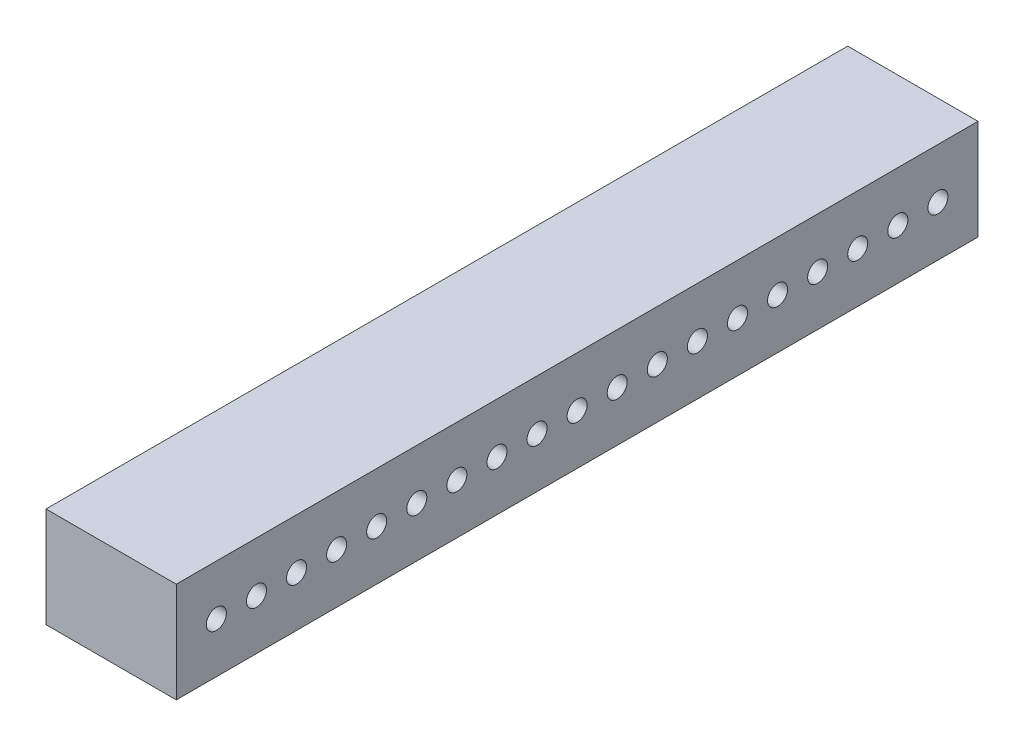
ISO-10303-21;
HEADER;
FILE_DESCRIPTION(('STEP AP214'),'2;1');
FILE_NAME('part.step','',(''),(''),'','','');
FILE_SCHEMA(('AUTOMOTIVE_DESIGN { 1 0 10303 214 1 1 1 1 }'));
ENDSEC;
DATA;
#1=APPLICATION_CONTEXT('core data for automotive mechanical design processes');
#2=APPLICATION_PROTOCOL_DEFINITION('international standard','automotive_design',2000,#1);
#3=PRODUCT_CONTEXT('',#1,'mechanical');
#4=PRODUCT('Part','Part','',(#3));
#5=PRODUCT_RELATED_PRODUCT_CATEGORY('part','',(#4));
#6=PRODUCT_DEFINITION_FORMATION('','',#4);
#7=PRODUCT_DEFINITION_CONTEXT('part definition',#1,'design');
#8=PRODUCT_DEFINITION('design','',#6,#7);
#9=PRODUCT_DEFINITION_SHAPE('','',#8);
#10=(LENGTH_UNIT() NAMED_UNIT(*) SI_UNIT(.MILLI.,.METRE.));
#11=(NAMED_UNIT(*) PLANE_ANGLE_UNIT() SI_UNIT($,.RADIAN.));
#12=(NAMED_UNIT(*) SI_UNIT($,.STERADIAN.) SOLID_ANGLE_UNIT());
#13=UNCERTAINTY_MEASURE_WITH_UNIT(LENGTH_MEASURE(1.E-05),#10,'distance_accuracy_value','');
#14=(GEOMETRIC_REPRESENTATION_CONTEXT(3) GLOBAL_UNCERTAINTY_ASSIGNED_CONTEXT((#13)) GLOBAL_UNIT_ASSIGNED_CONTEXT((#10,
#11,#12)) REPRESENTATION_CONTEXT('',''));
#15=CARTESIAN_POINT('',(0.,0.,0.));
#16=DIRECTION('',(0.,0.,1.));
#17=DIRECTION('',(1.,0.,0.));
#18=AXIS2_PLACEMENT_3D('',#15,#16,#17);
#19=CARTESIAN_POINT('',(65.,25.,-200.));
#20=DIRECTION('',(0.,0.,1.));
#21=DIRECTION('',(0.,-1.,0.));
#22=AXIS2_PLACEMENT_3D('',#19,#20,#21);
#23=PLANE('',#22);
#24=DIRECTION('',(0.,1.,0.));
#25=VECTOR('',#24,1.);
#26=CARTESIAN_POINT('',(0.,25.,-200.));
#27=LINE('',#26,#25);
#28=CARTESIAN_POINT('',(0.,-25.,-200.));
#29=VERTEX_POINT('',#28);
#30=CARTESIAN_POINT('',(0.,25.,-200.));
#31=VERTEX_POINT('',#30);
#32=EDGE_CURVE('E96',#29,#31,#27,.T.);
#33=ORIENTED_EDGE('',*,*,#32,.T.);
#34=DIRECTION('',(-1.,0.,0.));
#35=VECTOR('',#34,1.);
#36=CARTESIAN_POINT('',(65.,25.,-200.));
#37=LINE('',#36,#35);
#38=CARTESIAN_POINT('',(65.,25.,-200.));
#39=VERTEX_POINT('',#38);
#40=EDGE_CURVE('E11',#39,#31,#37,.T.);
#41=ORIENTED_EDGE('',*,*,#40,.F.);
#42=DIRECTION('',(0.,1.,0.));
#43=VECTOR('',#42,1.);
#44=CARTESIAN_POINT('',(65.,25.,-200.));
#45=LINE('',#44,#43);
#46=CARTESIAN_POINT('',(65.,-25.,-200.));
#47=VERTEX_POINT('',#46);
#48=EDGE_CURVE('E84',#47,#39,#45,.T.);
#49=ORIENTED_EDGE('',*,*,#48,.F.);
#50=DIRECTION('',(-1.,0.,0.));
#51=VECTOR('',#50,1.);
#52=CARTESIAN_POINT('',(65.,-25.,-200.));
#53=LINE('',#52,#51);
#54=EDGE_CURVE('E92',#47,#29,#53,.T.);
#55=ORIENTED_EDGE('',*,*,#54,.T.);
#56=EDGE_LOOP('',(#33,#41,#49,#55));
#57=FACE_BOUND('',#56,.T.);
#58=ADVANCED_FACE('F33',(#57),#23,.F.);
#59=CARTESIAN_POINT('',(65.,25.,200.));
#60=DIRECTION('',(0.,-1.,0.));
#61=DIRECTION('',(0.,0.,-1.));
#62=AXIS2_PLACEMENT_3D('',#59,#60,#61);
#63=PLANE('',#62);
#64=DIRECTION('',(0.,0.,1.));
#65=VECTOR('',#64,1.);
#66=CARTESIAN_POINT('',(0.,25.,200.));
#67=LINE('',#66,#65);
#68=CARTESIAN_POINT('',(0.,25.,200.));
#69=VERTEX_POINT('',#68);
#70=EDGE_CURVE('E88',#31,#69,#67,.T.);
#71=ORIENTED_EDGE('',*,*,#70,.T.);
#72=DIRECTION('',(-1.,0.,0.));
#73=VECTOR('',#72,1.);
#74=CARTESIAN_POINT('',(65.,25.,200.));
#75=LINE('',#74,#73);
#76=CARTESIAN_POINT('',(65.,25.,200.));
#77=VERTEX_POINT('',#76);
#78=EDGE_CURVE('E41',#77,#69,#75,.T.);
#79=ORIENTED_EDGE('',*,*,#78,.F.);
#80=DIRECTION('',(0.,0.,1.));
#81=VECTOR('',#80,1.);
#82=CARTESIAN_POINT('',(65.,25.,200.));
#83=LINE('',#82,#81);
#84=EDGE_CURVE('E79',#39,#77,#83,.T.);
#85=ORIENTED_EDGE('',*,*,#84,.F.);
#86=ORIENTED_EDGE('',*,*,#40,.T.);
#87=EDGE_LOOP('',(#71,#79,#85,#86));
#88=FACE_BOUND('',#87,.T.);
#89=ADVANCED_FACE('F87',(#88),#63,.F.);
#90=CARTESIAN_POINT('',(65.,25.,200.));
#91=DIRECTION('',(0.,0.,-1.));
#92=DIRECTION('',(0.,1.,0.));
#93=AXIS2_PLACEMENT_3D('',#90,#91,#92);
#94=PLANE('',#93);
#95=DIRECTION('',(0.,-1.,0.));
#96=VECTOR('',#95,1.);
#97=CARTESIAN_POINT('',(0.,25.,200.));
#98=LINE('',#97,#96);
#99=CARTESIAN_POINT('',(0.,-25.,200.));
#100=VERTEX_POINT('',#99);
#101=EDGE_CURVE('E66',#69,#100,#98,.T.);
#102=ORIENTED_EDGE('',*,*,#101,.T.);
#103=DIRECTION('',(-1.,0.,0.));
#104=VECTOR('',#103,1.);
#105=CARTESIAN_POINT('',(65.,-25.,200.));
#106=LINE('',#105,#104);
#107=CARTESIAN_POINT('',(65.,-25.,200.));
#108=VERTEX_POINT('',#107);
#109=EDGE_CURVE('E89',#108,#100,#106,.T.);
#110=ORIENTED_EDGE('',*,*,#109,.F.);
#111=DIRECTION('',(0.,-1.,0.));
#112=VECTOR('',#111,1.);
#113=CARTESIAN_POINT('',(65.,25.,200.));
#114=LINE('',#113,#112);
#115=EDGE_CURVE('E82',#77,#108,#114,.T.);
#116=ORIENTED_EDGE('',*,*,#115,.F.);
#117=ORIENTED_EDGE('',*,*,#78,.T.);
#118=EDGE_LOOP('',(#102,#110,#116,#117));
#119=FACE_BOUND('',#118,.T.);
#120=ADVANCED_FACE('F90',(#119),#94,.F.);
#121=CARTESIAN_POINT('',(65.,-25.,200.));
#122=DIRECTION('',(0.,1.,0.));
#123=DIRECTION('',(0.,0.,1.));
#124=AXIS2_PLACEMENT_3D('',#121,#122,#123);
#125=PLANE('',#124);
#126=DIRECTION('',(0.,0.,-1.));
#127=VECTOR('',#126,1.);
#128=CARTESIAN_POINT('',(0.,-25.,200.));
#129=LINE('',#128,#127);
#130=EDGE_CURVE('E72',#100,#29,#129,.T.);
#131=ORIENTED_EDGE('',*,*,#130,.T.);
#132=ORIENTED_EDGE('',*,*,#54,.F.);
#133=DIRECTION('',(0.,0.,-1.));
#134=VECTOR('',#133,1.);
#135=CARTESIAN_POINT('',(65.,-25.,200.));
#136=LINE('',#135,#134);
#137=EDGE_CURVE('E49',#108,#47,#136,.T.);
#138=ORIENTED_EDGE('',*,*,#137,.F.);
#139=ORIENTED_EDGE('',*,*,#109,.T.);
#140=EDGE_LOOP('',(#131,#132,#138,#139));
#141=FACE_BOUND('',#140,.T.);
#142=ADVANCED_FACE('F104',(#141),#125,.F.);
#143=CARTESIAN_POINT('',(65.,0.,0.));
#144=DIRECTION('',(1.,0.,0.));
#145=DIRECTION('',(0.,0.,-1.));
#146=AXIS2_PLACEMENT_3D('',#143,#144,#145);
#147=PLANE('',#146);
#148=CARTESIAN_POINT('',(65.,0.,-180.));
#149=DIRECTION('',(1.,0.,0.));
#150=DIRECTION('',(0.,0.,-1.));
#151=AXIS2_PLACEMENT_3D('',#148,#149,#150);
#152=CIRCLE('',#151,4.99999999999999);
#153=CARTESIAN_POINT('',(65.,0.,-185.));
#154=VERTEX_POINT('',#153);
#155=EDGE_CURVE('E218',#154,#154,#152,.T.);
#156=ORIENTED_EDGE('',*,*,#155,.F.);
#157=EDGE_LOOP('',(#156));
#158=FACE_BOUND('',#157,.T.);
#159=CARTESIAN_POINT('',(65.,0.,-160.));
#160=DIRECTION('',(1.,0.,0.));
#161=DIRECTION('',(0.,0.,-1.));
#162=AXIS2_PLACEMENT_3D('',#159,#160,#161);
#163=CIRCLE('',#162,4.99999999999999);
#164=CARTESIAN_POINT('',(65.,0.,-165.));
#165=VERTEX_POINT('',#164);
#166=EDGE_CURVE('E212',#165,#165,#163,.T.);
#167=ORIENTED_EDGE('',*,*,#166,.F.);
#168=EDGE_LOOP('',(#167));
#169=FACE_BOUND('',#168,.T.);
#170=CARTESIAN_POINT('',(65.,0.,-140.));
#171=DIRECTION('',(1.,0.,0.));
#172=DIRECTION('',(0.,0.,-1.));
#173=AXIS2_PLACEMENT_3D('',#170,#171,#172);
#174=CIRCLE('',#173,4.99999999999999);
#175=CARTESIAN_POINT('',(65.,0.,-145.));
#176=VERTEX_POINT('',#175);
#177=EDGE_CURVE('E206',#176,#176,#174,.T.);
#178=ORIENTED_EDGE('',*,*,#177,.F.);
#179=EDGE_LOOP('',(#178));
#180=FACE_BOUND('',#179,.T.);
#181=CARTESIAN_POINT('',(65.,0.,-120.));
#182=DIRECTION('',(1.,0.,0.));
#183=DIRECTION('',(0.,0.,-1.));
#184=AXIS2_PLACEMENT_3D('',#181,#182,#183);
#185=CIRCLE('',#184,4.99999999999999);
#186=CARTESIAN_POINT('',(65.,0.,-125.));
#187=VERTEX_POINT('',#186);
#188=EDGE_CURVE('E200',#187,#187,#185,.T.);
#189=ORIENTED_EDGE('',*,*,#188,.F.);
#190=EDGE_LOOP('',(#189));
#191=FACE_BOUND('',#190,.T.);
#192=CARTESIAN_POINT('',(65.,0.,-99.9999999999997));
#193=DIRECTION('',(1.,0.,0.));
#194=DIRECTION('',(0.,0.,-1.));
#195=AXIS2_PLACEMENT_3D('',#192,#193,#194);
#196=CIRCLE('',#195,4.99999999999999);
#197=CARTESIAN_POINT('',(65.,0.,-105.));
#198=VERTEX_POINT('',#197);
#199=EDGE_CURVE('E194',#198,#198,#196,.T.);
#200=ORIENTED_EDGE('',*,*,#199,.F.);
#201=EDGE_LOOP('',(#200));
#202=FACE_BOUND('',#201,.T.);
#203=CARTESIAN_POINT('',(65.,0.,-79.9999999999997));
#204=DIRECTION('',(1.,0.,0.));
#205=DIRECTION('',(0.,0.,-1.));
#206=AXIS2_PLACEMENT_3D('',#203,#204,#205);
#207=CIRCLE('',#206,4.99999999999999);
#208=CARTESIAN_POINT('',(65.,0.,-84.9999999999997));
#209=VERTEX_POINT('',#208);
#210=EDGE_CURVE('E188',#209,#209,#207,.T.);
#211=ORIENTED_EDGE('',*,*,#210,.F.);
#212=EDGE_LOOP('',(#211));
#213=FACE_BOUND('',#212,.T.);
#214=CARTESIAN_POINT('',(65.,0.,-59.9999999999997));
#215=DIRECTION('',(1.,0.,0.));
#216=DIRECTION('',(0.,0.,-1.));
#217=AXIS2_PLACEMENT_3D('',#214,#215,#216);
#218=CIRCLE('',#217,4.99999999999999);
#219=CARTESIAN_POINT('',(65.,0.,-64.9999999999997));
#220=VERTEX_POINT('',#219);
#221=EDGE_CURVE('E182',#220,#220,#218,.T.);
#222=ORIENTED_EDGE('',*,*,#221,.F.);
#223=EDGE_LOOP('',(#222));
#224=FACE_BOUND('',#223,.T.);
#225=CARTESIAN_POINT('',(65.,0.,-39.9999999999998));
#226=DIRECTION('',(1.,0.,0.));
#227=DIRECTION('',(0.,0.,-1.));
#228=AXIS2_PLACEMENT_3D('',#225,#226,#227);
#229=CIRCLE('',#228,4.99999999999999);
#230=CARTESIAN_POINT('',(65.,0.,-44.9999999999998));
#231=VERTEX_POINT('',#230);
#232=EDGE_CURVE('E176',#231,#231,#229,.T.);
#233=ORIENTED_EDGE('',*,*,#232,.F.);
#234=EDGE_LOOP('',(#233));
#235=FACE_BOUND('',#234,.T.);
#236=CARTESIAN_POINT('',(65.,0.,-19.9999999999998));
#237=DIRECTION('',(1.,0.,0.));
#238=DIRECTION('',(0.,0.,-1.));
#239=AXIS2_PLACEMENT_3D('',#236,#237,#238);
#240=CIRCLE('',#239,4.99999999999999);
#241=CARTESIAN_POINT('',(65.,0.,-24.9999999999998));
#242=VERTEX_POINT('',#241);
#243=EDGE_CURVE('E170',#242,#242,#240,.T.);
#244=ORIENTED_EDGE('',*,*,#243,.F.);
#245=EDGE_LOOP('',(#244));
#246=FACE_BOUND('',#245,.T.);
#247=CARTESIAN_POINT('',(65.,0.,2.22044604925031E-13));
#248=DIRECTION('',(1.,0.,0.));
#249=DIRECTION('',(0.,0.,-1.));
#250=AXIS2_PLACEMENT_3D('',#247,#248,#249);
#251=CIRCLE('',#250,4.99999999999999);
#252=CARTESIAN_POINT('',(65.,0.,-4.99999999999977));
#253=VERTEX_POINT('',#252);
#254=EDGE_CURVE('E164',#253,#253,#251,.T.);
#255=ORIENTED_EDGE('',*,*,#254,.F.);
#256=EDGE_LOOP('',(#255));
#257=FACE_BOUND('',#256,.T.);
#258=CARTESIAN_POINT('',(65.,0.,20.0000000000002));
#259=DIRECTION('',(1.,0.,0.));
#260=DIRECTION('',(0.,0.,-1.));
#261=AXIS2_PLACEMENT_3D('',#258,#259,#260);
#262=CIRCLE('',#261,4.99999999999999);
#263=CARTESIAN_POINT('',(65.,0.,15.0000000000002));
#264=VERTEX_POINT('',#263);
#265=EDGE_CURVE('E158',#264,#264,#262,.T.);
#266=ORIENTED_EDGE('',*,*,#265,.F.);
#267=EDGE_LOOP('',(#266));
#268=FACE_BOUND('',#267,.T.);
#269=CARTESIAN_POINT('',(65.,0.,40.0000000000002));
#270=DIRECTION('',(1.,0.,0.));
#271=DIRECTION('',(0.,0.,-1.));
#272=AXIS2_PLACEMENT_3D('',#269,#270,#271);
#273=CIRCLE('',#272,4.99999999999999);
#274=CARTESIAN_POINT('',(65.,0.,35.0000000000002));
#275=VERTEX_POINT('',#274);
#276=EDGE_CURVE('E152',#275,#275,#273,.T.);
#277=ORIENTED_EDGE('',*,*,#276,.F.);
#278=EDGE_LOOP('',(#277));
#279=FACE_BOUND('',#278,.T.);
#280=CARTESIAN_POINT('',(65.,0.,60.0000000000002));
#281=DIRECTION('',(1.,0.,0.));
#282=DIRECTION('',(0.,0.,-1.));
#283=AXIS2_PLACEMENT_3D('',#280,#281,#282);
#284=CIRCLE('',#283,4.99999999999999);
#285=CARTESIAN_POINT('',(65.,0.,55.0000000000002));
#286=VERTEX_POINT('',#285);
#287=EDGE_CURVE('E146',#286,#286,#284,.T.);
#288=ORIENTED_EDGE('',*,*,#287,.F.);
#289=EDGE_LOOP('',(#288));
#290=FACE_BOUND('',#289,.T.);
#291=CARTESIAN_POINT('',(65.,0.,80.0000000000002));
#292=DIRECTION('',(1.,0.,0.));
#293=DIRECTION('',(0.,0.,-1.));
#294=AXIS2_PLACEMENT_3D('',#291,#292,#293);
#295=CIRCLE('',#294,4.99999999999999);
#296=CARTESIAN_POINT('',(65.,0.,75.0000000000002));
#297=VERTEX_POINT('',#296);
#298=EDGE_CURVE('E140',#297,#297,#295,.T.);
#299=ORIENTED_EDGE('',*,*,#298,.F.);
#300=EDGE_LOOP('',(#299));
#301=FACE_BOUND('',#300,.T.);
#302=CARTESIAN_POINT('',(65.,0.,100.));
#303=DIRECTION('',(1.,0.,0.));
#304=DIRECTION('',(0.,0.,-1.));
#305=AXIS2_PLACEMENT_3D('',#302,#303,#304);
#306=CIRCLE('',#305,4.99999999999999);
#307=CARTESIAN_POINT('',(65.,0.,95.0000000000002));
#308=VERTEX_POINT('',#307);
#309=EDGE_CURVE('E134',#308,#308,#306,.T.);
#310=ORIENTED_EDGE('',*,*,#309,.F.);
#311=EDGE_LOOP('',(#310));
#312=FACE_BOUND('',#311,.T.);
#313=CARTESIAN_POINT('',(65.,0.,120.));
#314=DIRECTION('',(1.,0.,0.));
#315=DIRECTION('',(0.,0.,-1.));
#316=AXIS2_PLACEMENT_3D('',#313,#314,#315);
#317=CIRCLE('',#316,4.99999999999999);
#318=CARTESIAN_POINT('',(65.,0.,115.));
#319=VERTEX_POINT('',#318);
#320=EDGE_CURVE('E128',#319,#319,#317,.T.);
#321=ORIENTED_EDGE('',*,*,#320,.F.);
#322=EDGE_LOOP('',(#321));
#323=FACE_BOUND('',#322,.T.);
#324=CARTESIAN_POINT('',(65.,0.,140.));
#325=DIRECTION('',(1.,0.,0.));
#326=DIRECTION('',(0.,0.,-1.));
#327=AXIS2_PLACEMENT_3D('',#324,#325,#326);
#328=CIRCLE('',#327,4.99999999999999);
#329=CARTESIAN_POINT('',(65.,0.,135.));
#330=VERTEX_POINT('',#329);
#331=EDGE_CURVE('E122',#330,#330,#328,.T.);
#332=ORIENTED_EDGE('',*,*,#331,.F.);
#333=EDGE_LOOP('',(#332));
#334=FACE_BOUND('',#333,.T.);
#335=CARTESIAN_POINT('',(65.,0.,160.));
#336=DIRECTION('',(1.,0.,0.));
#337=DIRECTION('',(0.,0.,-1.));
#338=AXIS2_PLACEMENT_3D('',#335,#336,#337);
#339=CIRCLE('',#338,4.99999999999999);
#340=CARTESIAN_POINT('',(65.,0.,155.));
#341=VERTEX_POINT('',#340);
#342=EDGE_CURVE('E116',#341,#341,#339,.T.);
#343=ORIENTED_EDGE('',*,*,#342,.F.);
#344=EDGE_LOOP('',(#343));
#345=FACE_BOUND('',#344,.T.);
#346=CARTESIAN_POINT('',(65.,0.,180.));
#347=DIRECTION('',(1.,0.,0.));
#348=DIRECTION('',(0.,0.,-1.));
#349=AXIS2_PLACEMENT_3D('',#346,#347,#348);
#350=CIRCLE('',#349,4.99999999999999);
#351=CARTESIAN_POINT('',(65.,0.,175.));
#352=VERTEX_POINT('',#351);
#353=EDGE_CURVE('E110',#352,#352,#350,.T.);
#354=ORIENTED_EDGE('',*,*,#353,.F.);
#355=EDGE_LOOP('',(#354));
#356=FACE_BOUND('',#355,.T.);
#357=ORIENTED_EDGE('',*,*,#48,.T.);
#358=ORIENTED_EDGE('',*,*,#84,.T.);
#359=ORIENTED_EDGE('',*,*,#115,.T.);
#360=ORIENTED_EDGE('',*,*,#137,.T.);
#361=EDGE_LOOP('',(#357,#358,#359,#360));
#362=FACE_BOUND('',#361,.T.);
#363=ADVANCED_FACE('F80',(#158,#169,#180,#191,#202,#213,#224,#235,#246,#257,#268,#279,#290,#301,
#312,#323,#334,#345,#356,#362),#147,.T.);
#364=CARTESIAN_POINT('',(0.,0.,0.));
#365=DIRECTION('',(1.,0.,0.));
#366=DIRECTION('',(0.,0.,-1.));
#367=AXIS2_PLACEMENT_3D('',#364,#365,#366);
#368=PLANE('',#367);
#369=CARTESIAN_POINT('',(0.,0.,-180.));
#370=DIRECTION('',(1.,0.,0.));
#371=DIRECTION('',(0.,0.,-1.));
#372=AXIS2_PLACEMENT_3D('',#369,#370,#371);
#373=CIRCLE('',#372,4.99999999999999);
#374=CARTESIAN_POINT('',(0.,0.,-185.));
#375=VERTEX_POINT('',#374);
#376=EDGE_CURVE('E215',#375,#375,#373,.T.);
#377=ORIENTED_EDGE('',*,*,#376,.T.);
#378=EDGE_LOOP('',(#377));
#379=FACE_BOUND('',#378,.T.);
#380=CARTESIAN_POINT('',(0.,0.,-160.));
#381=DIRECTION('',(1.,0.,0.));
#382=DIRECTION('',(0.,0.,-1.));
#383=AXIS2_PLACEMENT_3D('',#380,#381,#382);
#384=CIRCLE('',#383,4.99999999999999);
#385=CARTESIAN_POINT('',(0.,0.,-165.));
#386=VERTEX_POINT('',#385);
#387=EDGE_CURVE('E209',#386,#386,#384,.T.);
#388=ORIENTED_EDGE('',*,*,#387,.T.);
#389=EDGE_LOOP('',(#388));
#390=FACE_BOUND('',#389,.T.);
#391=CARTESIAN_POINT('',(0.,0.,-140.));
#392=DIRECTION('',(1.,0.,0.));
#393=DIRECTION('',(0.,0.,-1.));
#394=AXIS2_PLACEMENT_3D('',#391,#392,#393);
#395=CIRCLE('',#394,4.99999999999999);
#396=CARTESIAN_POINT('',(0.,0.,-145.));
#397=VERTEX_POINT('',#396);
#398=EDGE_CURVE('E203',#397,#397,#395,.T.);
#399=ORIENTED_EDGE('',*,*,#398,.T.);
#400=EDGE_LOOP('',(#399));
#401=FACE_BOUND('',#400,.T.);
#402=CARTESIAN_POINT('',(0.,0.,-120.));
#403=DIRECTION('',(1.,0.,0.));
#404=DIRECTION('',(0.,0.,-1.));
#405=AXIS2_PLACEMENT_3D('',#402,#403,#404);
#406=CIRCLE('',#405,4.99999999999999);
#407=CARTESIAN_POINT('',(0.,0.,-125.));
#408=VERTEX_POINT('',#407);
#409=EDGE_CURVE('E197',#408,#408,#406,.T.);
#410=ORIENTED_EDGE('',*,*,#409,.T.);
#411=EDGE_LOOP('',(#410));
#412=FACE_BOUND('',#411,.T.);
#413=CARTESIAN_POINT('',(0.,0.,-99.9999999999997));
#414=DIRECTION('',(1.,0.,0.));
#415=DIRECTION('',(0.,0.,-1.));
#416=AXIS2_PLACEMENT_3D('',#413,#414,#415);
#417=CIRCLE('',#416,4.99999999999999);
#418=CARTESIAN_POINT('',(0.,0.,-105.));
#419=VERTEX_POINT('',#418);
#420=EDGE_CURVE('E191',#419,#419,#417,.T.);
#421=ORIENTED_EDGE('',*,*,#420,.T.);
#422=EDGE_LOOP('',(#421));
#423=FACE_BOUND('',#422,.T.);
#424=CARTESIAN_POINT('',(0.,0.,-79.9999999999997));
#425=DIRECTION('',(1.,0.,0.));
#426=DIRECTION('',(0.,0.,-1.));
#427=AXIS2_PLACEMENT_3D('',#424,#425,#426);
#428=CIRCLE('',#427,4.99999999999999);
#429=CARTESIAN_POINT('',(0.,0.,-84.9999999999997));
#430=VERTEX_POINT('',#429);
#431=EDGE_CURVE('E185',#430,#430,#428,.T.);
#432=ORIENTED_EDGE('',*,*,#431,.T.);
#433=EDGE_LOOP('',(#432));
#434=FACE_BOUND('',#433,.T.);
#435=CARTESIAN_POINT('',(0.,0.,-59.9999999999997));
#436=DIRECTION('',(1.,0.,0.));
#437=DIRECTION('',(0.,0.,-1.));
#438=AXIS2_PLACEMENT_3D('',#435,#436,#437);
#439=CIRCLE('',#438,4.99999999999999);
#440=CARTESIAN_POINT('',(0.,0.,-64.9999999999997));
#441=VERTEX_POINT('',#440);
#442=EDGE_CURVE('E179',#441,#441,#439,.T.);
#443=ORIENTED_EDGE('',*,*,#442,.T.);
#444=EDGE_LOOP('',(#443));
#445=FACE_BOUND('',#444,.T.);
#446=CARTESIAN_POINT('',(0.,0.,-39.9999999999998));
#447=DIRECTION('',(1.,0.,0.));
#448=DIRECTION('',(0.,0.,-1.));
#449=AXIS2_PLACEMENT_3D('',#446,#447,#448);
#450=CIRCLE('',#449,4.99999999999999);
#451=CARTESIAN_POINT('',(0.,0.,-44.9999999999998));
#452=VERTEX_POINT('',#451);
#453=EDGE_CURVE('E173',#452,#452,#450,.T.);
#454=ORIENTED_EDGE('',*,*,#453,.T.);
#455=EDGE_LOOP('',(#454));
#456=FACE_BOUND('',#455,.T.);
#457=CARTESIAN_POINT('',(0.,0.,-19.9999999999998));
#458=DIRECTION('',(1.,0.,0.));
#459=DIRECTION('',(0.,0.,-1.));
#460=AXIS2_PLACEMENT_3D('',#457,#458,#459);
#461=CIRCLE('',#460,4.99999999999999);
#462=CARTESIAN_POINT('',(0.,0.,-24.9999999999998));
#463=VERTEX_POINT('',#462);
#464=EDGE_CURVE('E167',#463,#463,#461,.T.);
#465=ORIENTED_EDGE('',*,*,#464,.T.);
#466=EDGE_LOOP('',(#465));
#467=FACE_BOUND('',#466,.T.);
#468=CARTESIAN_POINT('',(0.,0.,2.22044604925031E-13));
#469=DIRECTION('',(1.,0.,0.));
#470=DIRECTION('',(0.,0.,-1.));
#471=AXIS2_PLACEMENT_3D('',#468,#469,#470);
#472=CIRCLE('',#471,4.99999999999999);
#473=CARTESIAN_POINT('',(0.,0.,-4.99999999999977));
#474=VERTEX_POINT('',#473);
#475=EDGE_CURVE('E161',#474,#474,#472,.T.);
#476=ORIENTED_EDGE('',*,*,#475,.T.);
#477=EDGE_LOOP('',(#476));
#478=FACE_BOUND('',#477,.T.);
#479=CARTESIAN_POINT('',(0.,0.,20.0000000000002));
#480=DIRECTION('',(1.,0.,0.));
#481=DIRECTION('',(0.,0.,-1.));
#482=AXIS2_PLACEMENT_3D('',#479,#480,#481);
#483=CIRCLE('',#482,4.99999999999999);
#484=CARTESIAN_POINT('',(0.,0.,15.0000000000002));
#485=VERTEX_POINT('',#484);
#486=EDGE_CURVE('E155',#485,#485,#483,.T.);
#487=ORIENTED_EDGE('',*,*,#486,.T.);
#488=EDGE_LOOP('',(#487));
#489=FACE_BOUND('',#488,.T.);
#490=CARTESIAN_POINT('',(0.,0.,40.0000000000002));
#491=DIRECTION('',(1.,0.,0.));
#492=DIRECTION('',(0.,0.,-1.));
#493=AXIS2_PLACEMENT_3D('',#490,#491,#492);
#494=CIRCLE('',#493,4.99999999999999);
#495=CARTESIAN_POINT('',(0.,0.,35.0000000000002));
#496=VERTEX_POINT('',#495);
#497=EDGE_CURVE('E149',#496,#496,#494,.T.);
#498=ORIENTED_EDGE('',*,*,#497,.T.);
#499=EDGE_LOOP('',(#498));
#500=FACE_BOUND('',#499,.T.);
#501=CARTESIAN_POINT('',(0.,0.,60.0000000000002));
#502=DIRECTION('',(1.,0.,0.));
#503=DIRECTION('',(0.,0.,-1.));
#504=AXIS2_PLACEMENT_3D('',#501,#502,#503);
#505=CIRCLE('',#504,4.99999999999999);
#506=CARTESIAN_POINT('',(0.,0.,55.0000000000002));
#507=VERTEX_POINT('',#506);
#508=EDGE_CURVE('E143',#507,#507,#505,.T.);
#509=ORIENTED_EDGE('',*,*,#508,.T.);
#510=EDGE_LOOP('',(#509));
#511=FACE_BOUND('',#510,.T.);
#512=CARTESIAN_POINT('',(0.,0.,80.0000000000002));
#513=DIRECTION('',(1.,0.,0.));
#514=DIRECTION('',(0.,0.,-1.));
#515=AXIS2_PLACEMENT_3D('',#512,#513,#514);
#516=CIRCLE('',#515,4.99999999999999);
#517=CARTESIAN_POINT('',(0.,0.,75.0000000000002));
#518=VERTEX_POINT('',#517);
#519=EDGE_CURVE('E137',#518,#518,#516,.T.);
#520=ORIENTED_EDGE('',*,*,#519,.T.);
#521=EDGE_LOOP('',(#520));
#522=FACE_BOUND('',#521,.T.);
#523=CARTESIAN_POINT('',(0.,0.,100.));
#524=DIRECTION('',(1.,0.,0.));
#525=DIRECTION('',(0.,0.,-1.));
#526=AXIS2_PLACEMENT_3D('',#523,#524,#525);
#527=CIRCLE('',#526,4.99999999999999);
#528=CARTESIAN_POINT('',(0.,0.,95.0000000000002));
#529=VERTEX_POINT('',#528);
#530=EDGE_CURVE('E131',#529,#529,#527,.T.);
#531=ORIENTED_EDGE('',*,*,#530,.T.);
#532=EDGE_LOOP('',(#531));
#533=FACE_BOUND('',#532,.T.);
#534=CARTESIAN_POINT('',(0.,0.,120.));
#535=DIRECTION('',(1.,0.,0.));
#536=DIRECTION('',(0.,0.,-1.));
#537=AXIS2_PLACEMENT_3D('',#534,#535,#536);
#538=CIRCLE('',#537,4.99999999999999);
#539=CARTESIAN_POINT('',(0.,0.,115.));
#540=VERTEX_POINT('',#539);
#541=EDGE_CURVE('E125',#540,#540,#538,.T.);
#542=ORIENTED_EDGE('',*,*,#541,.T.);
#543=EDGE_LOOP('',(#542));
#544=FACE_BOUND('',#543,.T.);
#545=CARTESIAN_POINT('',(0.,0.,140.));
#546=DIRECTION('',(1.,0.,0.));
#547=DIRECTION('',(0.,0.,-1.));
#548=AXIS2_PLACEMENT_3D('',#545,#546,#547);
#549=CIRCLE('',#548,4.99999999999999);
#550=CARTESIAN_POINT('',(0.,0.,135.));
#551=VERTEX_POINT('',#550);
#552=EDGE_CURVE('E119',#551,#551,#549,.T.);
#553=ORIENTED_EDGE('',*,*,#552,.T.);
#554=EDGE_LOOP('',(#553));
#555=FACE_BOUND('',#554,.T.);
#556=CARTESIAN_POINT('',(0.,0.,160.));
#557=DIRECTION('',(1.,0.,0.));
#558=DIRECTION('',(0.,0.,-1.));
#559=AXIS2_PLACEMENT_3D('',#556,#557,#558);
#560=CIRCLE('',#559,4.99999999999999);
#561=CARTESIAN_POINT('',(0.,0.,155.));
#562=VERTEX_POINT('',#561);
#563=EDGE_CURVE('E113',#562,#562,#560,.T.);
#564=ORIENTED_EDGE('',*,*,#563,.T.);
#565=EDGE_LOOP('',(#564));
#566=FACE_BOUND('',#565,.T.);
#567=CARTESIAN_POINT('',(0.,0.,180.));
#568=DIRECTION('',(1.,0.,0.));
#569=DIRECTION('',(0.,0.,-1.));
#570=AXIS2_PLACEMENT_3D('',#567,#568,#569);
#571=CIRCLE('',#570,4.99999999999999);
#572=CARTESIAN_POINT('',(0.,0.,175.));
#573=VERTEX_POINT('',#572);
#574=EDGE_CURVE('E99',#573,#573,#571,.T.);
#575=ORIENTED_EDGE('',*,*,#574,.T.);
#576=EDGE_LOOP('',(#575));
#577=FACE_BOUND('',#576,.T.);
#578=ORIENTED_EDGE('',*,*,#32,.F.);
#579=ORIENTED_EDGE('',*,*,#130,.F.);
#580=ORIENTED_EDGE('',*,*,#101,.F.);
#581=ORIENTED_EDGE('',*,*,#70,.F.);
#582=EDGE_LOOP('',(#578,#579,#580,#581));
#583=FACE_BOUND('',#582,.T.);
#584=ADVANCED_FACE('F107',(#379,#390,#401,#412,#423,#434,#445,#456,#467,#478,#489,#500,#511,
#522,#533,#544,#555,#566,#577,#583),#368,.F.);
#585=CARTESIAN_POINT('',(0.,0.,180.));
#586=DIRECTION('',(1.,0.,0.));
#587=DIRECTION('',(0.,0.,-1.));
#588=AXIS2_PLACEMENT_3D('',#585,#586,#587);
#589=CYLINDRICAL_SURFACE('',#588,4.99999999999999);
#590=ORIENTED_EDGE('',*,*,#574,.F.);
#591=EDGE_LOOP('',(#590));
#592=FACE_BOUND('',#591,.T.);
#593=ORIENTED_EDGE('',*,*,#353,.T.);
#594=EDGE_LOOP('',(#593));
#595=FACE_BOUND('',#594,.T.);
#596=ADVANCED_FACE('F272',(#592,#595),#589,.F.);
#597=CARTESIAN_POINT('',(0.,0.,160.));
#598=DIRECTION('',(1.,0.,0.));
#599=DIRECTION('',(0.,0.,-1.));
#600=AXIS2_PLACEMENT_3D('',#597,#598,#599);
#601=CYLINDRICAL_SURFACE('',#600,4.99999999999999);
#602=ORIENTED_EDGE('',*,*,#563,.F.);
#603=EDGE_LOOP('',(#602));
#604=FACE_BOUND('',#603,.T.);
#605=ORIENTED_EDGE('',*,*,#342,.T.);
#606=EDGE_LOOP('',(#605));
#607=FACE_BOUND('',#606,.T.);
#608=ADVANCED_FACE('F274',(#604,#607),#601,.F.);
#609=CARTESIAN_POINT('',(0.,0.,140.));
#610=DIRECTION('',(1.,0.,0.));
#611=DIRECTION('',(0.,0.,-1.));
#612=AXIS2_PLACEMENT_3D('',#609,#610,#611);
#613=CYLINDRICAL_SURFACE('',#612,4.99999999999999);
#614=ORIENTED_EDGE('',*,*,#552,.F.);
#615=EDGE_LOOP('',(#614));
#616=FACE_BOUND('',#615,.T.);
#617=ORIENTED_EDGE('',*,*,#331,.T.);
#618=EDGE_LOOP('',(#617));
#619=FACE_BOUND('',#618,.T.);
#620=ADVANCED_FACE('F281',(#616,#619),#613,.F.);
#621=CARTESIAN_POINT('',(0.,0.,120.));
#622=DIRECTION('',(1.,0.,0.));
#623=DIRECTION('',(0.,0.,-1.));
#624=AXIS2_PLACEMENT_3D('',#621,#622,#623);
#625=CYLINDRICAL_SURFACE('',#624,4.99999999999999);
#626=ORIENTED_EDGE('',*,*,#541,.F.);
#627=EDGE_LOOP('',(#626));
#628=FACE_BOUND('',#627,.T.);
#629=ORIENTED_EDGE('',*,*,#320,.T.);
#630=EDGE_LOOP('',(#629));
#631=FACE_BOUND('',#630,.T.);
#632=ADVANCED_FACE('F327',(#628,#631),#625,.F.);
#633=CARTESIAN_POINT('',(0.,0.,100.));
#634=DIRECTION('',(1.,0.,0.));
#635=DIRECTION('',(0.,0.,-1.));
#636=AXIS2_PLACEMENT_3D('',#633,#634,#635);
#637=CYLINDRICAL_SURFACE('',#636,4.99999999999999);
#638=ORIENTED_EDGE('',*,*,#530,.F.);
#639=EDGE_LOOP('',(#638));
#640=FACE_BOUND('',#639,.T.);
#641=ORIENTED_EDGE('',*,*,#309,.T.);
#642=EDGE_LOOP('',(#641));
#643=FACE_BOUND('',#642,.T.);
#644=ADVANCED_FACE('F337',(#640,#643),#637,.F.);
#645=CARTESIAN_POINT('',(0.,0.,80.0000000000002));
#646=DIRECTION('',(1.,0.,0.));
#647=DIRECTION('',(0.,0.,-1.));
#648=AXIS2_PLACEMENT_3D('',#645,#646,#647);
#649=CYLINDRICAL_SURFACE('',#648,4.99999999999999);
#650=ORIENTED_EDGE('',*,*,#519,.F.);
#651=EDGE_LOOP('',(#650));
#652=FACE_BOUND('',#651,.T.);
#653=ORIENTED_EDGE('',*,*,#298,.T.);
#654=EDGE_LOOP('',(#653));
#655=FACE_BOUND('',#654,.T.);
#656=ADVANCED_FACE('F347',(#652,#655),#649,.F.);
#657=CARTESIAN_POINT('',(0.,0.,60.0000000000002));
#658=DIRECTION('',(1.,0.,0.));
#659=DIRECTION('',(0.,0.,-1.));
#660=AXIS2_PLACEMENT_3D('',#657,#658,#659);
#661=CYLINDRICAL_SURFACE('',#660,4.99999999999999);
#662=ORIENTED_EDGE('',*,*,#508,.F.);
#663=EDGE_LOOP('',(#662));
#664=FACE_BOUND('',#663,.T.);
#665=ORIENTED_EDGE('',*,*,#287,.T.);
#666=EDGE_LOOP('',(#665));
#667=FACE_BOUND('',#666,.T.);
#668=ADVANCED_FACE('F357',(#664,#667),#661,.F.);
#669=CARTESIAN_POINT('',(0.,0.,40.0000000000002));
#670=DIRECTION('',(1.,0.,0.));
#671=DIRECTION('',(0.,0.,-1.));
#672=AXIS2_PLACEMENT_3D('',#669,#670,#671);
#673=CYLINDRICAL_SURFACE('',#672,4.99999999999999);
#674=ORIENTED_EDGE('',*,*,#497,.F.);
#675=EDGE_LOOP('',(#674));
#676=FACE_BOUND('',#675,.T.);
#677=ORIENTED_EDGE('',*,*,#276,.T.);
#678=EDGE_LOOP('',(#677));
#679=FACE_BOUND('',#678,.T.);
#680=ADVANCED_FACE('F367',(#676,#679),#673,.F.);
#681=CARTESIAN_POINT('',(0.,0.,20.0000000000002));
#682=DIRECTION('',(1.,0.,0.));
#683=DIRECTION('',(0.,0.,-1.));
#684=AXIS2_PLACEMENT_3D('',#681,#682,#683);
#685=CYLINDRICAL_SURFACE('',#684,4.99999999999999);
#686=ORIENTED_EDGE('',*,*,#486,.F.);
#687=EDGE_LOOP('',(#686));
#688=FACE_BOUND('',#687,.T.);
#689=ORIENTED_EDGE('',*,*,#265,.T.);
#690=EDGE_LOOP('',(#689));
#691=FACE_BOUND('',#690,.T.);
#692=ADVANCED_FACE('F377',(#688,#691),#685,.F.);
#693=CARTESIAN_POINT('',(0.,0.,2.22044604925031E-13));
#694=DIRECTION('',(1.,0.,0.));
#695=DIRECTION('',(0.,0.,-1.));
#696=AXIS2_PLACEMENT_3D('',#693,#694,#695);
#697=CYLINDRICAL_SURFACE('',#696,4.99999999999999);
#698=ORIENTED_EDGE('',*,*,#475,.F.);
#699=EDGE_LOOP('',(#698));
#700=FACE_BOUND('',#699,.T.);
#701=ORIENTED_EDGE('',*,*,#254,.T.);
#702=EDGE_LOOP('',(#701));
#703=FACE_BOUND('',#702,.T.);
#704=ADVANCED_FACE('F387',(#700,#703),#697,.F.);
#705=CARTESIAN_POINT('',(0.,0.,-19.9999999999998));
#706=DIRECTION('',(1.,0.,0.));
#707=DIRECTION('',(0.,0.,-1.));
#708=AXIS2_PLACEMENT_3D('',#705,#706,#707);
#709=CYLINDRICAL_SURFACE('',#708,4.99999999999999);
#710=ORIENTED_EDGE('',*,*,#464,.F.);
#711=EDGE_LOOP('',(#710));
#712=FACE_BOUND('',#711,.T.);
#713=ORIENTED_EDGE('',*,*,#243,.T.);
#714=EDGE_LOOP('',(#713));
#715=FACE_BOUND('',#714,.T.);
#716=ADVANCED_FACE('F397',(#712,#715),#709,.F.);
#717=CARTESIAN_POINT('',(0.,0.,-39.9999999999998));
#718=DIRECTION('',(1.,0.,0.));
#719=DIRECTION('',(0.,0.,-1.));
#720=AXIS2_PLACEMENT_3D('',#717,#718,#719);
#721=CYLINDRICAL_SURFACE('',#720,4.99999999999999);
#722=ORIENTED_EDGE('',*,*,#453,.F.);
#723=EDGE_LOOP('',(#722));
#724=FACE_BOUND('',#723,.T.);
#725=ORIENTED_EDGE('',*,*,#232,.T.);
#726=EDGE_LOOP('',(#725));
#727=FACE_BOUND('',#726,.T.);
#728=ADVANCED_FACE('F407',(#724,#727),#721,.F.);
#729=CARTESIAN_POINT('',(0.,0.,-59.9999999999997));
#730=DIRECTION('',(1.,0.,0.));
#731=DIRECTION('',(0.,0.,-1.));
#732=AXIS2_PLACEMENT_3D('',#729,#730,#731);
#733=CYLINDRICAL_SURFACE('',#732,4.99999999999999);
#734=ORIENTED_EDGE('',*,*,#442,.F.);
#735=EDGE_LOOP('',(#734));
#736=FACE_BOUND('',#735,.T.);
#737=ORIENTED_EDGE('',*,*,#221,.T.);
#738=EDGE_LOOP('',(#737));
#739=FACE_BOUND('',#738,.T.);
#740=ADVANCED_FACE('F417',(#736,#739),#733,.F.);
#741=CARTESIAN_POINT('',(0.,0.,-79.9999999999997));
#742=DIRECTION('',(1.,0.,0.));
#743=DIRECTION('',(0.,0.,-1.));
#744=AXIS2_PLACEMENT_3D('',#741,#742,#743);
#745=CYLINDRICAL_SURFACE('',#744,4.99999999999999);
#746=ORIENTED_EDGE('',*,*,#431,.F.);
#747=EDGE_LOOP('',(#746));
#748=FACE_BOUND('',#747,.T.);
#749=ORIENTED_EDGE('',*,*,#210,.T.);
#750=EDGE_LOOP('',(#749));
#751=FACE_BOUND('',#750,.T.);
#752=ADVANCED_FACE('F427',(#748,#751),#745,.F.);
#753=CARTESIAN_POINT('',(0.,0.,-99.9999999999997));
#754=DIRECTION('',(1.,0.,0.));
#755=DIRECTION('',(0.,0.,-1.));
#756=AXIS2_PLACEMENT_3D('',#753,#754,#755);
#757=CYLINDRICAL_SURFACE('',#756,4.99999999999999);
#758=ORIENTED_EDGE('',*,*,#420,.F.);
#759=EDGE_LOOP('',(#758));
#760=FACE_BOUND('',#759,.T.);
#761=ORIENTED_EDGE('',*,*,#199,.T.);
#762=EDGE_LOOP('',(#761));
#763=FACE_BOUND('',#762,.T.);
#764=ADVANCED_FACE('F437',(#760,#763),#757,.F.);
#765=CARTESIAN_POINT('',(0.,0.,-120.));
#766=DIRECTION('',(1.,0.,0.));
#767=DIRECTION('',(0.,0.,-1.));
#768=AXIS2_PLACEMENT_3D('',#765,#766,#767);
#769=CYLINDRICAL_SURFACE('',#768,4.99999999999999);
#770=ORIENTED_EDGE('',*,*,#409,.F.);
#771=EDGE_LOOP('',(#770));
#772=FACE_BOUND('',#771,.T.);
#773=ORIENTED_EDGE('',*,*,#188,.T.);
#774=EDGE_LOOP('',(#773));
#775=FACE_BOUND('',#774,.T.);
#776=ADVANCED_FACE('F447',(#772,#775),#769,.F.);
#777=CARTESIAN_POINT('',(0.,0.,-140.));
#778=DIRECTION('',(1.,0.,0.));
#779=DIRECTION('',(0.,0.,-1.));
#780=AXIS2_PLACEMENT_3D('',#777,#778,#779);
#781=CYLINDRICAL_SURFACE('',#780,4.99999999999999);
#782=ORIENTED_EDGE('',*,*,#398,.F.);
#783=EDGE_LOOP('',(#782));
#784=FACE_BOUND('',#783,.T.);
#785=ORIENTED_EDGE('',*,*,#177,.T.);
#786=EDGE_LOOP('',(#785));
#787=FACE_BOUND('',#786,.T.);
#788=ADVANCED_FACE('F457',(#784,#787),#781,.F.);
#789=CARTESIAN_POINT('',(0.,0.,-160.));
#790=DIRECTION('',(1.,0.,0.));
#791=DIRECTION('',(0.,0.,-1.));
#792=AXIS2_PLACEMENT_3D('',#789,#790,#791);
#793=CYLINDRICAL_SURFACE('',#792,4.99999999999999);
#794=ORIENTED_EDGE('',*,*,#387,.F.);
#795=EDGE_LOOP('',(#794));
#796=FACE_BOUND('',#795,.T.);
#797=ORIENTED_EDGE('',*,*,#166,.T.);
#798=EDGE_LOOP('',(#797));
#799=FACE_BOUND('',#798,.T.);
#800=ADVANCED_FACE('F229',(#796,#799),#793,.F.);
#801=CARTESIAN_POINT('',(0.,0.,-180.));
#802=DIRECTION('',(1.,0.,0.));
#803=DIRECTION('',(0.,0.,-1.));
#804=AXIS2_PLACEMENT_3D('',#801,#802,#803);
#805=CYLINDRICAL_SURFACE('',#804,4.99999999999999);
#806=ORIENTED_EDGE('',*,*,#376,.F.);
#807=EDGE_LOOP('',(#806));
#808=FACE_BOUND('',#807,.T.);
#809=ORIENTED_EDGE('',*,*,#155,.T.);
#810=EDGE_LOOP('',(#809));
#811=FACE_BOUND('',#810,.T.);
#812=ADVANCED_FACE('F226',(#808,#811),#805,.F.);
#813=CLOSED_SHELL('',(#58,#89,#120,#142,#363,#584,#596,#608,#620,#632,#644,#656,#668,#680,#692,
#704,#716,#728,#740,#752,#764,#776,#788,#800,#812));
#814=MANIFOLD_SOLID_BREP('B2',#813);
#815=ADVANCED_BREP_SHAPE_REPRESENTATION('',(#18,#814),#14);
#816=SHAPE_DEFINITION_REPRESENTATION(#9,#815);
ENDSEC;
END-ISO-10303-21;
